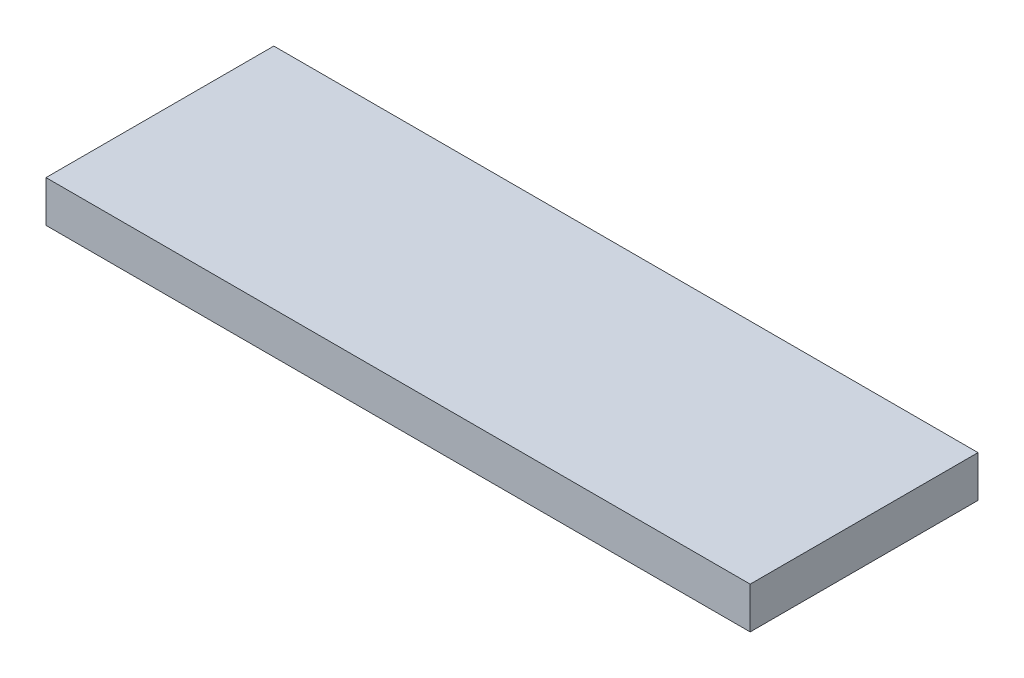
ISO-10303-21;
HEADER;
FILE_DESCRIPTION(('STEP AP214'),'2;1');
FILE_NAME('part.step','',(''),(''),'','','');
FILE_SCHEMA(('AUTOMOTIVE_DESIGN { 1 0 10303 214 1 1 1 1 }'));
ENDSEC;
DATA;
#1=APPLICATION_CONTEXT('core data for automotive mechanical design processes');
#2=APPLICATION_PROTOCOL_DEFINITION('international standard','automotive_design',2000,#1);
#3=PRODUCT_CONTEXT('',#1,'mechanical');
#4=PRODUCT('Part','Part','',(#3));
#5=PRODUCT_RELATED_PRODUCT_CATEGORY('part','',(#4));
#6=PRODUCT_DEFINITION_FORMATION('','',#4);
#7=PRODUCT_DEFINITION_CONTEXT('part definition',#1,'design');
#8=PRODUCT_DEFINITION('design','',#6,#7);
#9=PRODUCT_DEFINITION_SHAPE('','',#8);
#10=(LENGTH_UNIT() NAMED_UNIT(*) SI_UNIT(.MILLI.,.METRE.));
#11=(NAMED_UNIT(*) PLANE_ANGLE_UNIT() SI_UNIT($,.RADIAN.));
#12=(NAMED_UNIT(*) SI_UNIT($,.STERADIAN.) SOLID_ANGLE_UNIT());
#13=UNCERTAINTY_MEASURE_WITH_UNIT(LENGTH_MEASURE(1.E-05),#10,'distance_accuracy_value','');
#14=(GEOMETRIC_REPRESENTATION_CONTEXT(3) GLOBAL_UNCERTAINTY_ASSIGNED_CONTEXT((#13)) GLOBAL_UNIT_ASSIGNED_CONTEXT((#10,
#11,#12)) REPRESENTATION_CONTEXT('',''));
#15=CARTESIAN_POINT('',(0.,0.,0.));
#16=DIRECTION('',(0.,0.,1.));
#17=DIRECTION('',(1.,0.,0.));
#18=AXIS2_PLACEMENT_3D('',#15,#16,#17);
#19=CARTESIAN_POINT('',(-96.0674157303371,10.,-17.8651685393258));
#20=DIRECTION('',(1.,0.,0.));
#21=DIRECTION('',(0.,0.,-1.));
#22=AXIS2_PLACEMENT_3D('',#19,#20,#21);
#23=PLANE('',#22);
#24=DIRECTION('',(0.,0.,1.));
#25=VECTOR('',#24,1.);
#26=CARTESIAN_POINT('',(-96.0674157303371,0.,-17.8651685393258));
#27=LINE('',#26,#25);
#28=CARTESIAN_POINT('',(-96.0674157303371,0.,-17.8651685393258));
#29=VERTEX_POINT('',#28);
#30=CARTESIAN_POINT('',(-96.0674157303371,0.,37.1348314606742));
#31=VERTEX_POINT('',#30);
#32=EDGE_CURVE('E99',#29,#31,#27,.T.);
#33=ORIENTED_EDGE('',*,*,#32,.T.);
#34=DIRECTION('',(0.,-1.,0.));
#35=VECTOR('',#34,1.);
#36=CARTESIAN_POINT('',(-96.0674157303371,10.,37.1348314606742));
#37=LINE('',#36,#35);
#38=CARTESIAN_POINT('',(-96.0674157303371,10.,37.1348314606742));
#39=VERTEX_POINT('',#38);
#40=EDGE_CURVE('E11',#39,#31,#37,.T.);
#41=ORIENTED_EDGE('',*,*,#40,.F.);
#42=DIRECTION('',(0.,0.,1.));
#43=VECTOR('',#42,1.);
#44=CARTESIAN_POINT('',(-96.0674157303371,10.,-17.8651685393258));
#45=LINE('',#44,#43);
#46=CARTESIAN_POINT('',(-96.0674157303371,10.,-17.8651685393258));
#47=VERTEX_POINT('',#46);
#48=EDGE_CURVE('E87',#47,#39,#45,.T.);
#49=ORIENTED_EDGE('',*,*,#48,.F.);
#50=DIRECTION('',(0.,-1.,0.));
#51=VECTOR('',#50,1.);
#52=CARTESIAN_POINT('',(-96.0674157303371,10.,-17.8651685393258));
#53=LINE('',#52,#51);
#54=EDGE_CURVE('E95',#47,#29,#53,.T.);
#55=ORIENTED_EDGE('',*,*,#54,.T.);
#56=EDGE_LOOP('',(#33,#41,#49,#55));
#57=FACE_BOUND('',#56,.T.);
#58=ADVANCED_FACE('F36',(#57),#23,.F.);
#59=CARTESIAN_POINT('',(-96.0674157303371,10.,37.1348314606742));
#60=DIRECTION('',(0.,0.,-1.));
#61=DIRECTION('',(-1.,0.,0.));
#62=AXIS2_PLACEMENT_3D('',#59,#60,#61);
#63=PLANE('',#62);
#64=DIRECTION('',(1.,0.,0.));
#65=VECTOR('',#64,1.);
#66=CARTESIAN_POINT('',(-96.0674157303371,0.,37.1348314606742));
#67=LINE('',#66,#65);
#68=CARTESIAN_POINT('',(73.9325842696629,0.,37.1348314606742));
#69=VERTEX_POINT('',#68);
#70=EDGE_CURVE('E91',#31,#69,#67,.T.);
#71=ORIENTED_EDGE('',*,*,#70,.T.);
#72=DIRECTION('',(0.,-1.,0.));
#73=VECTOR('',#72,1.);
#74=CARTESIAN_POINT('',(73.9325842696629,10.,37.1348314606742));
#75=LINE('',#74,#73);
#76=CARTESIAN_POINT('',(73.9325842696629,10.,37.1348314606742));
#77=VERTEX_POINT('',#76);
#78=EDGE_CURVE('E44',#77,#69,#75,.T.);
#79=ORIENTED_EDGE('',*,*,#78,.F.);
#80=DIRECTION('',(1.,0.,0.));
#81=VECTOR('',#80,1.);
#82=CARTESIAN_POINT('',(-96.0674157303371,10.,37.1348314606742));
#83=LINE('',#82,#81);
#84=EDGE_CURVE('E82',#39,#77,#83,.T.);
#85=ORIENTED_EDGE('',*,*,#84,.F.);
#86=ORIENTED_EDGE('',*,*,#40,.T.);
#87=EDGE_LOOP('',(#71,#79,#85,#86));
#88=FACE_BOUND('',#87,.T.);
#89=ADVANCED_FACE('F90',(#88),#63,.F.);
#90=CARTESIAN_POINT('',(73.9325842696629,10.,-17.8651685393258));
#91=DIRECTION('',(-1.,0.,0.));
#92=DIRECTION('',(0.,0.,1.));
#93=AXIS2_PLACEMENT_3D('',#90,#91,#92);
#94=PLANE('',#93);
#95=DIRECTION('',(0.,0.,-1.));
#96=VECTOR('',#95,1.);
#97=CARTESIAN_POINT('',(73.9325842696629,0.,-17.8651685393258));
#98=LINE('',#97,#96);
#99=CARTESIAN_POINT('',(73.9325842696629,0.,-17.8651685393258));
#100=VERTEX_POINT('',#99);
#101=EDGE_CURVE('E69',#69,#100,#98,.T.);
#102=ORIENTED_EDGE('',*,*,#101,.T.);
#103=DIRECTION('',(0.,-1.,0.));
#104=VECTOR('',#103,1.);
#105=CARTESIAN_POINT('',(73.9325842696629,10.,-17.8651685393258));
#106=LINE('',#105,#104);
#107=CARTESIAN_POINT('',(73.9325842696629,10.,-17.8651685393258));
#108=VERTEX_POINT('',#107);
#109=EDGE_CURVE('E92',#108,#100,#106,.T.);
#110=ORIENTED_EDGE('',*,*,#109,.F.);
#111=DIRECTION('',(0.,0.,-1.));
#112=VECTOR('',#111,1.);
#113=CARTESIAN_POINT('',(73.9325842696629,10.,-17.8651685393258));
#114=LINE('',#113,#112);
#115=EDGE_CURVE('E85',#77,#108,#114,.T.);
#116=ORIENTED_EDGE('',*,*,#115,.F.);
#117=ORIENTED_EDGE('',*,*,#78,.T.);
#118=EDGE_LOOP('',(#102,#110,#116,#117));
#119=FACE_BOUND('',#118,.T.);
#120=ADVANCED_FACE('F93',(#119),#94,.F.);
#121=CARTESIAN_POINT('',(-96.0674157303371,10.,-17.8651685393258));
#122=DIRECTION('',(0.,0.,1.));
#123=DIRECTION('',(1.,0.,0.));
#124=AXIS2_PLACEMENT_3D('',#121,#122,#123);
#125=PLANE('',#124);
#126=DIRECTION('',(-1.,0.,0.));
#127=VECTOR('',#126,1.);
#128=CARTESIAN_POINT('',(-96.0674157303371,0.,-17.8651685393258));
#129=LINE('',#128,#127);
#130=EDGE_CURVE('E75',#100,#29,#129,.T.);
#131=ORIENTED_EDGE('',*,*,#130,.T.);
#132=ORIENTED_EDGE('',*,*,#54,.F.);
#133=DIRECTION('',(-1.,0.,0.));
#134=VECTOR('',#133,1.);
#135=CARTESIAN_POINT('',(-96.0674157303371,10.,-17.8651685393258));
#136=LINE('',#135,#134);
#137=EDGE_CURVE('E52',#108,#47,#136,.T.);
#138=ORIENTED_EDGE('',*,*,#137,.F.);
#139=ORIENTED_EDGE('',*,*,#109,.T.);
#140=EDGE_LOOP('',(#131,#132,#138,#139));
#141=FACE_BOUND('',#140,.T.);
#142=ADVANCED_FACE('F106',(#141),#125,.F.);
#143=CARTESIAN_POINT('',(0.,10.,0.));
#144=DIRECTION('',(0.,1.,0.));
#145=DIRECTION('',(0.,0.,1.));
#146=AXIS2_PLACEMENT_3D('',#143,#144,#145);
#147=PLANE('',#146);
#148=ORIENTED_EDGE('',*,*,#48,.T.);
#149=ORIENTED_EDGE('',*,*,#84,.T.);
#150=ORIENTED_EDGE('',*,*,#115,.T.);
#151=ORIENTED_EDGE('',*,*,#137,.T.);
#152=EDGE_LOOP('',(#148,#149,#150,#151));
#153=FACE_BOUND('',#152,.T.);
#154=ADVANCED_FACE('F83',(#153),#147,.T.);
#155=CARTESIAN_POINT('',(0.,0.,0.));
#156=DIRECTION('',(0.,1.,0.));
#157=DIRECTION('',(0.,0.,1.));
#158=AXIS2_PLACEMENT_3D('',#155,#156,#157);
#159=PLANE('',#158);
#160=ORIENTED_EDGE('',*,*,#32,.F.);
#161=ORIENTED_EDGE('',*,*,#130,.F.);
#162=ORIENTED_EDGE('',*,*,#101,.F.);
#163=ORIENTED_EDGE('',*,*,#70,.F.);
#164=EDGE_LOOP('',(#160,#161,#162,#163));
#165=FACE_BOUND('',#164,.T.);
#166=ADVANCED_FACE('F109',(#165),#159,.F.);
#167=CLOSED_SHELL('',(#58,#89,#120,#142,#154,#166));
#168=MANIFOLD_SOLID_BREP('B2',#167);
#169=ADVANCED_BREP_SHAPE_REPRESENTATION('',(#18,#168),#14);
#170=SHAPE_DEFINITION_REPRESENTATION(#9,#169);
ENDSEC;
END-ISO-10303-21;
